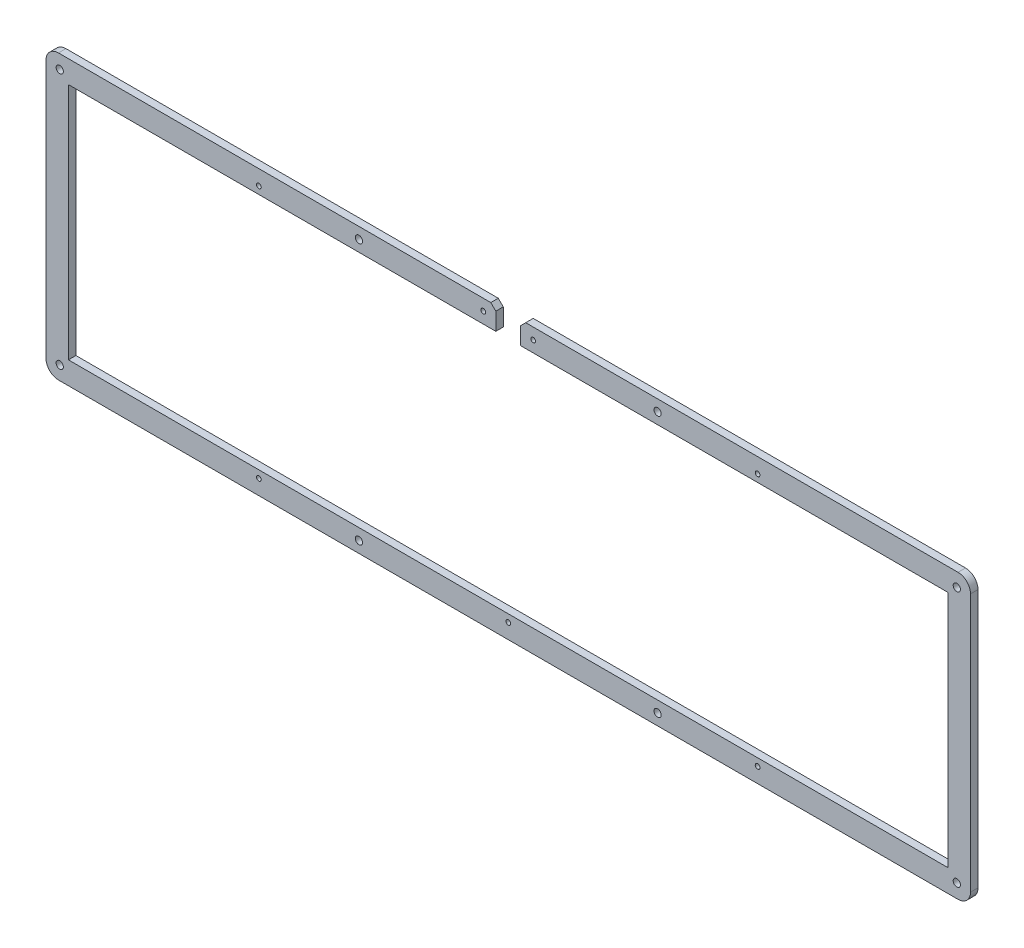
ISO-10303-21;
HEADER;
FILE_DESCRIPTION(('STEP AP214'),'2;1');
FILE_NAME('part.step','',(''),(''),'','','');
FILE_SCHEMA(('AUTOMOTIVE_DESIGN { 1 0 10303 214 1 1 1 1 }'));
ENDSEC;
DATA;
#1=APPLICATION_CONTEXT('core data for automotive mechanical design processes');
#2=APPLICATION_PROTOCOL_DEFINITION('international standard','automotive_design',2000,#1);
#3=PRODUCT_CONTEXT('',#1,'mechanical');
#4=PRODUCT('Part','Part','',(#3));
#5=PRODUCT_RELATED_PRODUCT_CATEGORY('part','',(#4));
#6=PRODUCT_DEFINITION_FORMATION('','',#4);
#7=PRODUCT_DEFINITION_CONTEXT('part definition',#1,'design');
#8=PRODUCT_DEFINITION('design','',#6,#7);
#9=PRODUCT_DEFINITION_SHAPE('','',#8);
#10=(LENGTH_UNIT() NAMED_UNIT(*) SI_UNIT(.MILLI.,.METRE.));
#11=(NAMED_UNIT(*) PLANE_ANGLE_UNIT() SI_UNIT($,.RADIAN.));
#12=(NAMED_UNIT(*) SI_UNIT($,.STERADIAN.) SOLID_ANGLE_UNIT());
#13=UNCERTAINTY_MEASURE_WITH_UNIT(LENGTH_MEASURE(1.E-05),#10,'distance_accuracy_value','');
#14=(GEOMETRIC_REPRESENTATION_CONTEXT(3) GLOBAL_UNCERTAINTY_ASSIGNED_CONTEXT((#13)) GLOBAL_UNIT_ASSIGNED_CONTEXT((#10,
#11,#12)) REPRESENTATION_CONTEXT('',''));
#15=CARTESIAN_POINT('',(0.,0.,0.));
#16=DIRECTION('',(0.,0.,1.));
#17=DIRECTION('',(1.,0.,0.));
#18=AXIS2_PLACEMENT_3D('',#15,#16,#17);
#19=CARTESIAN_POINT('',(-1.72756497465992E-13,113.599999999987,3.));
#20=DIRECTION('',(0.,1.,0.));
#21=DIRECTION('',(-1.,0.,0.));
#22=AXIS2_PLACEMENT_3D('',#19,#20,#21);
#23=PLANE('',#22);
#24=DIRECTION('',(1.,0.,0.));
#25=VECTOR('',#24,1.);
#26=CARTESIAN_POINT('',(-1.72756497465992E-13,113.599999999987,0.));
#27=LINE('',#26,#25);
#28=CARTESIAN_POINT('',(5.00000000000091,113.599999999987,0.));
#29=VERTEX_POINT('',#28);
#30=CARTESIAN_POINT('',(178.387499999993,113.599999999987,0.));
#31=VERTEX_POINT('',#30);
#32=EDGE_CURVE('E233',#29,#31,#27,.T.);
#33=ORIENTED_EDGE('',*,*,#32,.F.);
#34=DIRECTION('',(0.,0.,-1.));
#35=VECTOR('',#34,1.);
#36=CARTESIAN_POINT('',(5.00000000000091,113.599999999987,3.));
#37=LINE('',#36,#35);
#38=CARTESIAN_POINT('',(5.00000000000091,113.599999999987,3.));
#39=VERTEX_POINT('',#38);
#40=EDGE_CURVE('E11',#39,#29,#37,.T.);
#41=ORIENTED_EDGE('',*,*,#40,.F.);
#42=DIRECTION('',(1.,0.,0.));
#43=VECTOR('',#42,1.);
#44=CARTESIAN_POINT('',(-1.72756497465992E-13,113.599999999987,3.));
#45=LINE('',#44,#43);
#46=CARTESIAN_POINT('',(178.387499999993,113.599999999987,3.));
#47=VERTEX_POINT('',#46);
#48=EDGE_CURVE('E469',#39,#47,#45,.T.);
#49=ORIENTED_EDGE('',*,*,#48,.T.);
#50=DIRECTION('',(0.,0.,-1.));
#51=VECTOR('',#50,1.);
#52=CARTESIAN_POINT('',(178.387499999993,113.599999999987,3.));
#53=LINE('',#52,#51);
#54=EDGE_CURVE('E116',#47,#31,#53,.T.);
#55=ORIENTED_EDGE('',*,*,#54,.T.);
#56=EDGE_LOOP('',(#33,#41,#49,#55));
#57=FACE_BOUND('',#56,.T.);
#58=ADVANCED_FACE('F35',(#57),#23,.T.);
#59=CARTESIAN_POINT('',(5.00000000000091,108.599999999987,3.));
#60=DIRECTION('',(0.,0.,-1.));
#61=DIRECTION('',(-1.,0.,0.));
#62=AXIS2_PLACEMENT_3D('',#59,#60,#61);
#63=CYLINDRICAL_SURFACE('',#62,5.);
#64=CARTESIAN_POINT('',(5.00000000000091,108.599999999987,0.));
#65=DIRECTION('',(0.,0.,1.));
#66=DIRECTION('',(1.,0.,0.));
#67=AXIS2_PLACEMENT_3D('',#64,#65,#66);
#68=CIRCLE('',#67,5.);
#69=CARTESIAN_POINT('',(0.,108.599999999987,0.));
#70=VERTEX_POINT('',#69);
#71=EDGE_CURVE('E231',#29,#70,#68,.T.);
#72=ORIENTED_EDGE('',*,*,#71,.T.);
#73=DIRECTION('',(0.,0.,-1.));
#74=VECTOR('',#73,1.);
#75=CARTESIAN_POINT('',(0.,108.599999999987,3.));
#76=LINE('',#75,#74);
#77=CARTESIAN_POINT('',(0.,108.599999999987,3.));
#78=VERTEX_POINT('',#77);
#79=EDGE_CURVE('E44',#78,#70,#76,.T.);
#80=ORIENTED_EDGE('',*,*,#79,.F.);
#81=CARTESIAN_POINT('',(5.00000000000091,108.599999999987,3.));
#82=DIRECTION('',(0.,0.,1.));
#83=DIRECTION('',(1.,0.,0.));
#84=AXIS2_PLACEMENT_3D('',#81,#82,#83);
#85=CIRCLE('',#84,5.);
#86=EDGE_CURVE('E471',#39,#78,#85,.T.);
#87=ORIENTED_EDGE('',*,*,#86,.F.);
#88=ORIENTED_EDGE('',*,*,#40,.T.);
#89=EDGE_LOOP('',(#72,#80,#87,#88));
#90=FACE_BOUND('',#89,.T.);
#91=ADVANCED_FACE('F232',(#90),#63,.T.);
#92=CARTESIAN_POINT('',(0.,0.,3.));
#93=DIRECTION('',(1.,0.,0.));
#94=DIRECTION('',(0.,0.,-1.));
#95=AXIS2_PLACEMENT_3D('',#92,#93,#94);
#96=PLANE('',#95);
#97=DIRECTION('',(0.,-1.,0.));
#98=VECTOR('',#97,1.);
#99=CARTESIAN_POINT('',(0.,0.,0.));
#100=LINE('',#99,#98);
#101=CARTESIAN_POINT('',(0.,5.00000000000057,0.));
#102=VERTEX_POINT('',#101);
#103=EDGE_CURVE('E225',#70,#102,#100,.T.);
#104=ORIENTED_EDGE('',*,*,#103,.T.);
#105=DIRECTION('',(0.,0.,-1.));
#106=VECTOR('',#105,1.);
#107=CARTESIAN_POINT('',(0.,5.00000000000057,3.));
#108=LINE('',#107,#106);
#109=CARTESIAN_POINT('',(0.,5.00000000000057,3.));
#110=VERTEX_POINT('',#109);
#111=EDGE_CURVE('E216',#110,#102,#108,.T.);
#112=ORIENTED_EDGE('',*,*,#111,.F.);
#113=DIRECTION('',(0.,-1.,0.));
#114=VECTOR('',#113,1.);
#115=CARTESIAN_POINT('',(0.,0.,3.));
#116=LINE('',#115,#114);
#117=EDGE_CURVE('E227',#78,#110,#116,.T.);
#118=ORIENTED_EDGE('',*,*,#117,.F.);
#119=ORIENTED_EDGE('',*,*,#79,.T.);
#120=EDGE_LOOP('',(#104,#112,#118,#119));
#121=FACE_BOUND('',#120,.T.);
#122=ADVANCED_FACE('F223',(#121),#96,.F.);
#123=CARTESIAN_POINT('',(5.00000000000091,5.00000000000057,3.));
#124=DIRECTION('',(0.,0.,-1.));
#125=DIRECTION('',(-1.,0.,0.));
#126=AXIS2_PLACEMENT_3D('',#123,#124,#125);
#127=CYLINDRICAL_SURFACE('',#126,5.);
#128=CARTESIAN_POINT('',(5.00000000000091,5.00000000000057,0.));
#129=DIRECTION('',(0.,0.,1.));
#130=DIRECTION('',(1.,0.,0.));
#131=AXIS2_PLACEMENT_3D('',#128,#129,#130);
#132=CIRCLE('',#131,5.);
#133=CARTESIAN_POINT('',(5.00000000000091,0.,0.));
#134=VERTEX_POINT('',#133);
#135=EDGE_CURVE('E235',#102,#134,#132,.T.);
#136=ORIENTED_EDGE('',*,*,#135,.T.);
#137=DIRECTION('',(0.,0.,-1.));
#138=VECTOR('',#137,1.);
#139=CARTESIAN_POINT('',(5.00000000000091,0.,3.));
#140=LINE('',#139,#138);
#141=CARTESIAN_POINT('',(5.00000000000091,0.,3.));
#142=VERTEX_POINT('',#141);
#143=EDGE_CURVE('E214',#142,#134,#140,.T.);
#144=ORIENTED_EDGE('',*,*,#143,.F.);
#145=CARTESIAN_POINT('',(5.00000000000091,5.00000000000057,3.));
#146=DIRECTION('',(0.,0.,1.));
#147=DIRECTION('',(1.,0.,0.));
#148=AXIS2_PLACEMENT_3D('',#145,#146,#147);
#149=CIRCLE('',#148,5.);
#150=EDGE_CURVE('E478',#110,#142,#149,.T.);
#151=ORIENTED_EDGE('',*,*,#150,.F.);
#152=ORIENTED_EDGE('',*,*,#111,.T.);
#153=EDGE_LOOP('',(#136,#144,#151,#152));
#154=FACE_BOUND('',#153,.T.);
#155=ADVANCED_FACE('F351',(#154),#127,.T.);
#156=CARTESIAN_POINT('',(0.,0.,3.));
#157=DIRECTION('',(0.,-1.,0.));
#158=DIRECTION('',(1.,0.,0.));
#159=AXIS2_PLACEMENT_3D('',#156,#157,#158);
#160=PLANE('',#159);
#161=DIRECTION('',(-1.,0.,0.));
#162=VECTOR('',#161,1.);
#163=CARTESIAN_POINT('',(0.,0.,0.));
#164=LINE('',#163,#162);
#165=CARTESIAN_POINT('',(365.774999999985,-5.76312148397536E-13,0.));
#166=VERTEX_POINT('',#165);
#167=EDGE_CURVE('E243',#166,#134,#164,.T.);
#168=ORIENTED_EDGE('',*,*,#167,.F.);
#169=DIRECTION('',(0.,0.,-1.));
#170=VECTOR('',#169,1.);
#171=CARTESIAN_POINT('',(365.774999999985,-5.76312148397536E-13,3.));
#172=LINE('',#171,#170);
#173=CARTESIAN_POINT('',(365.774999999985,-5.76312148397536E-13,3.));
#174=VERTEX_POINT('',#173);
#175=EDGE_CURVE('E212',#174,#166,#172,.T.);
#176=ORIENTED_EDGE('',*,*,#175,.F.);
#177=DIRECTION('',(-1.,0.,0.));
#178=VECTOR('',#177,1.);
#179=CARTESIAN_POINT('',(0.,0.,3.));
#180=LINE('',#179,#178);
#181=EDGE_CURVE('E480',#174,#142,#180,.T.);
#182=ORIENTED_EDGE('',*,*,#181,.T.);
#183=ORIENTED_EDGE('',*,*,#143,.T.);
#184=EDGE_LOOP('',(#168,#176,#182,#183));
#185=FACE_BOUND('',#184,.T.);
#186=ADVANCED_FACE('F354',(#185),#160,.T.);
#187=CARTESIAN_POINT('',(365.774999999985,5.,3.));
#188=DIRECTION('',(0.,0.,-1.));
#189=DIRECTION('',(-1.,0.,0.));
#190=AXIS2_PLACEMENT_3D('',#187,#188,#189);
#191=CYLINDRICAL_SURFACE('',#190,5.);
#192=CARTESIAN_POINT('',(365.774999999985,5.,0.));
#193=DIRECTION('',(0.,0.,1.));
#194=DIRECTION('',(1.,0.,0.));
#195=AXIS2_PLACEMENT_3D('',#192,#193,#194);
#196=CIRCLE('',#195,5.);
#197=CARTESIAN_POINT('',(370.774999999985,5.00000000000057,0.));
#198=VERTEX_POINT('',#197);
#199=EDGE_CURVE('E246',#166,#198,#196,.T.);
#200=ORIENTED_EDGE('',*,*,#199,.T.);
#201=DIRECTION('',(0.,0.,-1.));
#202=VECTOR('',#201,1.);
#203=CARTESIAN_POINT('',(370.774999999985,5.00000000000057,3.));
#204=LINE('',#203,#202);
#205=CARTESIAN_POINT('',(370.774999999985,5.00000000000057,3.));
#206=VERTEX_POINT('',#205);
#207=EDGE_CURVE('E210',#206,#198,#204,.T.);
#208=ORIENTED_EDGE('',*,*,#207,.F.);
#209=CARTESIAN_POINT('',(365.774999999985,5.,3.));
#210=DIRECTION('',(0.,0.,1.));
#211=DIRECTION('',(1.,0.,0.));
#212=AXIS2_PLACEMENT_3D('',#209,#210,#211);
#213=CIRCLE('',#212,5.);
#214=EDGE_CURVE('E483',#174,#206,#213,.T.);
#215=ORIENTED_EDGE('',*,*,#214,.F.);
#216=ORIENTED_EDGE('',*,*,#175,.T.);
#217=EDGE_LOOP('',(#200,#208,#215,#216));
#218=FACE_BOUND('',#217,.T.);
#219=ADVANCED_FACE('F358',(#218),#191,.T.);
#220=CARTESIAN_POINT('',(370.774999999985,0.,3.));
#221=DIRECTION('',(1.,0.,0.));
#222=DIRECTION('',(0.,0.,-1.));
#223=AXIS2_PLACEMENT_3D('',#220,#221,#222);
#224=PLANE('',#223);
#225=DIRECTION('',(0.,-1.,0.));
#226=VECTOR('',#225,1.);
#227=CARTESIAN_POINT('',(370.774999999985,0.,0.));
#228=LINE('',#227,#226);
#229=CARTESIAN_POINT('',(370.774999999985,108.6,0.));
#230=VERTEX_POINT('',#229);
#231=EDGE_CURVE('E249',#230,#198,#228,.T.);
#232=ORIENTED_EDGE('',*,*,#231,.F.);
#233=DIRECTION('',(0.,0.,-1.));
#234=VECTOR('',#233,1.);
#235=CARTESIAN_POINT('',(370.774999999985,108.6,3.));
#236=LINE('',#235,#234);
#237=CARTESIAN_POINT('',(370.774999999985,108.6,3.));
#238=VERTEX_POINT('',#237);
#239=EDGE_CURVE('E208',#238,#230,#236,.T.);
#240=ORIENTED_EDGE('',*,*,#239,.F.);
#241=DIRECTION('',(0.,-1.,0.));
#242=VECTOR('',#241,1.);
#243=CARTESIAN_POINT('',(370.774999999985,0.,3.));
#244=LINE('',#243,#242);
#245=EDGE_CURVE('E485',#238,#206,#244,.T.);
#246=ORIENTED_EDGE('',*,*,#245,.T.);
#247=ORIENTED_EDGE('',*,*,#207,.T.);
#248=EDGE_LOOP('',(#232,#240,#246,#247));
#249=FACE_BOUND('',#248,.T.);
#250=ADVANCED_FACE('F362',(#249),#224,.T.);
#251=CARTESIAN_POINT('',(365.774999999985,108.599999999999,3.));
#252=DIRECTION('',(0.,0.,-1.));
#253=DIRECTION('',(-1.,0.,0.));
#254=AXIS2_PLACEMENT_3D('',#251,#252,#253);
#255=CYLINDRICAL_SURFACE('',#254,5.);
#256=CARTESIAN_POINT('',(365.774999999985,108.599999999999,0.));
#257=DIRECTION('',(0.,0.,1.));
#258=DIRECTION('',(1.,0.,0.));
#259=AXIS2_PLACEMENT_3D('',#256,#257,#258);
#260=CIRCLE('',#259,5.);
#261=CARTESIAN_POINT('',(365.774999999985,113.599999999999,0.));
#262=VERTEX_POINT('',#261);
#263=EDGE_CURVE('E252',#230,#262,#260,.T.);
#264=ORIENTED_EDGE('',*,*,#263,.T.);
#265=DIRECTION('',(0.,0.,-1.));
#266=VECTOR('',#265,1.);
#267=CARTESIAN_POINT('',(365.774999999985,113.599999999999,3.));
#268=LINE('',#267,#266);
#269=CARTESIAN_POINT('',(365.774999999985,113.599999999999,3.));
#270=VERTEX_POINT('',#269);
#271=EDGE_CURVE('E206',#270,#262,#268,.T.);
#272=ORIENTED_EDGE('',*,*,#271,.F.);
#273=CARTESIAN_POINT('',(365.774999999985,108.599999999999,3.));
#274=DIRECTION('',(0.,0.,1.));
#275=DIRECTION('',(1.,0.,0.));
#276=AXIS2_PLACEMENT_3D('',#273,#274,#275);
#277=CIRCLE('',#276,5.);
#278=EDGE_CURVE('E488',#238,#270,#277,.T.);
#279=ORIENTED_EDGE('',*,*,#278,.F.);
#280=ORIENTED_EDGE('',*,*,#239,.T.);
#281=EDGE_LOOP('',(#264,#272,#279,#280));
#282=FACE_BOUND('',#281,.T.);
#283=ADVANCED_FACE('F366',(#282),#255,.T.);
#284=CARTESIAN_POINT('',(0.,113.599999999999,3.));
#285=DIRECTION('',(0.,1.,0.));
#286=DIRECTION('',(0.,0.,1.));
#287=AXIS2_PLACEMENT_3D('',#284,#285,#286);
#288=PLANE('',#287);
#289=DIRECTION('',(1.,0.,0.));
#290=VECTOR('',#289,1.);
#291=CARTESIAN_POINT('',(0.,113.599999999999,0.));
#292=LINE('',#291,#290);
#293=CARTESIAN_POINT('',(192.387499999993,113.599999999999,0.));
#294=VERTEX_POINT('',#293);
#295=EDGE_CURVE('E255',#294,#262,#292,.T.);
#296=ORIENTED_EDGE('',*,*,#295,.F.);
#297=DIRECTION('',(0.,0.,-1.));
#298=VECTOR('',#297,1.);
#299=CARTESIAN_POINT('',(192.387499999993,113.599999999999,3.));
#300=LINE('',#299,#298);
#301=CARTESIAN_POINT('',(192.387499999993,113.599999999999,3.));
#302=VERTEX_POINT('',#301);
#303=EDGE_CURVE('E204',#302,#294,#300,.T.);
#304=ORIENTED_EDGE('',*,*,#303,.F.);
#305=DIRECTION('',(1.,0.,0.));
#306=VECTOR('',#305,1.);
#307=CARTESIAN_POINT('',(0.,113.599999999999,3.));
#308=LINE('',#307,#306);
#309=EDGE_CURVE('E490',#302,#270,#308,.T.);
#310=ORIENTED_EDGE('',*,*,#309,.T.);
#311=ORIENTED_EDGE('',*,*,#271,.T.);
#312=EDGE_LOOP('',(#296,#304,#310,#311));
#313=FACE_BOUND('',#312,.T.);
#314=ADVANCED_FACE('F370',(#313),#288,.T.);
#315=CARTESIAN_POINT('',(39.3937499999968,-39.3937499999968,3.));
#316=DIRECTION('',(-0.707106781186547,0.707106781186547,0.));
#317=DIRECTION('',(-0.707106781186548,-0.707106781186548,0.));
#318=AXIS2_PLACEMENT_3D('',#315,#316,#317);
#319=PLANE('',#318);
#320=DIRECTION('',(0.707106781186548,0.707106781186548,0.));
#321=VECTOR('',#320,1.);
#322=CARTESIAN_POINT('',(39.3937499999968,-39.3937499999968,0.));
#323=LINE('',#322,#321);
#324=CARTESIAN_POINT('',(190.387499999994,111.6,0.));
#325=VERTEX_POINT('',#324);
#326=EDGE_CURVE('E258',#325,#294,#323,.T.);
#327=ORIENTED_EDGE('',*,*,#326,.F.);
#328=DIRECTION('',(0.,0.,-1.));
#329=VECTOR('',#328,1.);
#330=CARTESIAN_POINT('',(190.387499999994,111.6,3.));
#331=LINE('',#330,#329);
#332=CARTESIAN_POINT('',(190.387499999994,111.6,3.));
#333=VERTEX_POINT('',#332);
#334=EDGE_CURVE('E202',#333,#325,#331,.T.);
#335=ORIENTED_EDGE('',*,*,#334,.F.);
#336=DIRECTION('',(0.707106781186548,0.707106781186548,0.));
#337=VECTOR('',#336,1.);
#338=CARTESIAN_POINT('',(39.3937499999968,-39.3937499999968,3.));
#339=LINE('',#338,#337);
#340=EDGE_CURVE('E493',#333,#302,#339,.T.);
#341=ORIENTED_EDGE('',*,*,#340,.T.);
#342=ORIENTED_EDGE('',*,*,#303,.T.);
#343=EDGE_LOOP('',(#327,#335,#341,#342));
#344=FACE_BOUND('',#343,.T.);
#345=ADVANCED_FACE('F374',(#344),#319,.T.);
#346=CARTESIAN_POINT('',(190.387500000026,5.51078528048986E-11,3.));
#347=DIRECTION('',(-1.,-2.89451002848879E-13,0.));
#348=DIRECTION('',(2.89451002848879E-13,-1.,0.));
#349=AXIS2_PLACEMENT_3D('',#346,#347,#348);
#350=PLANE('',#349);
#351=DIRECTION('',(-2.89451002848879E-13,1.,0.));
#352=VECTOR('',#351,1.);
#353=CARTESIAN_POINT('',(190.387500000026,5.51078528048986E-11,0.));
#354=LINE('',#353,#352);
#355=CARTESIAN_POINT('',(190.387499999996,104.600000000004,0.));
#356=VERTEX_POINT('',#355);
#357=EDGE_CURVE('E261',#356,#325,#354,.T.);
#358=ORIENTED_EDGE('',*,*,#357,.F.);
#359=DIRECTION('',(0.,0.,-1.));
#360=VECTOR('',#359,1.);
#361=CARTESIAN_POINT('',(190.387499999996,104.600000000004,3.));
#362=LINE('',#361,#360);
#363=CARTESIAN_POINT('',(190.387499999996,104.600000000004,3.));
#364=VERTEX_POINT('',#363);
#365=EDGE_CURVE('E200',#364,#356,#362,.T.);
#366=ORIENTED_EDGE('',*,*,#365,.F.);
#367=DIRECTION('',(-2.89451002848879E-13,1.,0.));
#368=VECTOR('',#367,1.);
#369=CARTESIAN_POINT('',(190.387500000026,5.51078528048986E-11,3.));
#370=LINE('',#369,#368);
#371=EDGE_CURVE('E496',#364,#333,#370,.T.);
#372=ORIENTED_EDGE('',*,*,#371,.T.);
#373=ORIENTED_EDGE('',*,*,#334,.T.);
#374=EDGE_LOOP('',(#358,#366,#372,#373));
#375=FACE_BOUND('',#374,.T.);
#376=ADVANCED_FACE('F378',(#375),#350,.T.);
#377=CARTESIAN_POINT('',(0.,104.600000000004,3.));
#378=DIRECTION('',(0.,1.,0.));
#379=DIRECTION('',(0.,0.,1.));
#380=AXIS2_PLACEMENT_3D('',#377,#378,#379);
#381=PLANE('',#380);
#382=DIRECTION('',(1.,0.,0.));
#383=VECTOR('',#382,1.);
#384=CARTESIAN_POINT('',(0.,104.600000000004,0.));
#385=LINE('',#384,#383);
#386=CARTESIAN_POINT('',(361.774999999976,104.600000000004,0.));
#387=VERTEX_POINT('',#386);
#388=EDGE_CURVE('E264',#356,#387,#385,.T.);
#389=ORIENTED_EDGE('',*,*,#388,.T.);
#390=DIRECTION('',(0.,0.,-1.));
#391=VECTOR('',#390,1.);
#392=CARTESIAN_POINT('',(361.774999999976,104.600000000004,3.));
#393=LINE('',#392,#391);
#394=CARTESIAN_POINT('',(361.774999999976,104.600000000004,3.));
#395=VERTEX_POINT('',#394);
#396=EDGE_CURVE('E197',#395,#387,#393,.T.);
#397=ORIENTED_EDGE('',*,*,#396,.F.);
#398=DIRECTION('',(1.,0.,0.));
#399=VECTOR('',#398,1.);
#400=CARTESIAN_POINT('',(0.,104.600000000004,3.));
#401=LINE('',#400,#399);
#402=EDGE_CURVE('E499',#364,#395,#401,.T.);
#403=ORIENTED_EDGE('',*,*,#402,.F.);
#404=ORIENTED_EDGE('',*,*,#365,.T.);
#405=EDGE_LOOP('',(#389,#397,#403,#404));
#406=FACE_BOUND('',#405,.T.);
#407=ADVANCED_FACE('F382',(#406),#381,.F.);
#408=CARTESIAN_POINT('',(361.774999999976,0.,3.));
#409=DIRECTION('',(1.,0.,0.));
#410=DIRECTION('',(0.,0.,-1.));
#411=AXIS2_PLACEMENT_3D('',#408,#409,#410);
#412=PLANE('',#411);
#413=DIRECTION('',(0.,-1.,0.));
#414=VECTOR('',#413,1.);
#415=CARTESIAN_POINT('',(361.774999999976,0.,0.));
#416=LINE('',#415,#414);
#417=CARTESIAN_POINT('',(361.774999999976,9.00000000000057,0.));
#418=VERTEX_POINT('',#417);
#419=EDGE_CURVE('E267',#387,#418,#416,.T.);
#420=ORIENTED_EDGE('',*,*,#419,.T.);
#421=DIRECTION('',(0.,0.,-1.));
#422=VECTOR('',#421,1.);
#423=CARTESIAN_POINT('',(361.774999999976,9.00000000000057,3.));
#424=LINE('',#423,#422);
#425=CARTESIAN_POINT('',(361.774999999976,9.00000000000057,3.));
#426=VERTEX_POINT('',#425);
#427=EDGE_CURVE('E194',#426,#418,#424,.T.);
#428=ORIENTED_EDGE('',*,*,#427,.F.);
#429=DIRECTION('',(0.,-1.,0.));
#430=VECTOR('',#429,1.);
#431=CARTESIAN_POINT('',(361.774999999976,0.,3.));
#432=LINE('',#431,#430);
#433=EDGE_CURVE('E502',#395,#426,#432,.T.);
#434=ORIENTED_EDGE('',*,*,#433,.F.);
#435=ORIENTED_EDGE('',*,*,#396,.T.);
#436=EDGE_LOOP('',(#420,#428,#434,#435));
#437=FACE_BOUND('',#436,.T.);
#438=ADVANCED_FACE('F386',(#437),#412,.F.);
#439=CARTESIAN_POINT('',(0.,9.00000000000057,3.));
#440=DIRECTION('',(0.,-1.,0.));
#441=DIRECTION('',(1.,0.,0.));
#442=AXIS2_PLACEMENT_3D('',#439,#440,#441);
#443=PLANE('',#442);
#444=DIRECTION('',(-1.,0.,0.));
#445=VECTOR('',#444,1.);
#446=CARTESIAN_POINT('',(0.,9.00000000000057,0.));
#447=LINE('',#446,#445);
#448=CARTESIAN_POINT('',(9.00000000000364,9.00000000000057,0.));
#449=VERTEX_POINT('',#448);
#450=EDGE_CURVE('E270',#418,#449,#447,.T.);
#451=ORIENTED_EDGE('',*,*,#450,.T.);
#452=DIRECTION('',(0.,0.,-1.));
#453=VECTOR('',#452,1.);
#454=CARTESIAN_POINT('',(9.00000000000364,9.00000000000057,3.));
#455=LINE('',#454,#453);
#456=CARTESIAN_POINT('',(9.00000000000364,9.00000000000057,3.));
#457=VERTEX_POINT('',#456);
#458=EDGE_CURVE('E188',#457,#449,#455,.T.);
#459=ORIENTED_EDGE('',*,*,#458,.F.);
#460=DIRECTION('',(-1.,0.,0.));
#461=VECTOR('',#460,1.);
#462=CARTESIAN_POINT('',(0.,9.00000000000057,3.));
#463=LINE('',#462,#461);
#464=EDGE_CURVE('E505',#426,#457,#463,.T.);
#465=ORIENTED_EDGE('',*,*,#464,.F.);
#466=ORIENTED_EDGE('',*,*,#427,.T.);
#467=EDGE_LOOP('',(#451,#459,#465,#466));
#468=FACE_BOUND('',#467,.T.);
#469=ADVANCED_FACE('F390',(#468),#443,.F.);
#470=CARTESIAN_POINT('',(9.00000000000364,0.,3.));
#471=DIRECTION('',(1.,0.,0.));
#472=DIRECTION('',(0.,0.,-1.));
#473=AXIS2_PLACEMENT_3D('',#470,#471,#472);
#474=PLANE('',#473);
#475=DIRECTION('',(0.,-1.,0.));
#476=VECTOR('',#475,1.);
#477=CARTESIAN_POINT('',(9.00000000000364,0.,0.));
#478=LINE('',#477,#476);
#479=CARTESIAN_POINT('',(9.00000000000364,104.599999999987,0.));
#480=VERTEX_POINT('',#479);
#481=EDGE_CURVE('E273',#480,#449,#478,.T.);
#482=ORIENTED_EDGE('',*,*,#481,.F.);
#483=DIRECTION('',(0.,0.,-1.));
#484=VECTOR('',#483,1.);
#485=CARTESIAN_POINT('',(9.00000000000364,104.599999999987,3.));
#486=LINE('',#485,#484);
#487=CARTESIAN_POINT('',(9.00000000000364,104.599999999987,3.));
#488=VERTEX_POINT('',#487);
#489=EDGE_CURVE('E186',#488,#480,#486,.T.);
#490=ORIENTED_EDGE('',*,*,#489,.F.);
#491=DIRECTION('',(0.,-1.,0.));
#492=VECTOR('',#491,1.);
#493=CARTESIAN_POINT('',(9.00000000000364,0.,3.));
#494=LINE('',#493,#492);
#495=EDGE_CURVE('E180',#488,#457,#494,.T.);
#496=ORIENTED_EDGE('',*,*,#495,.T.);
#497=ORIENTED_EDGE('',*,*,#458,.T.);
#498=EDGE_LOOP('',(#482,#490,#496,#497));
#499=FACE_BOUND('',#498,.T.);
#500=ADVANCED_FACE('F394',(#499),#474,.T.);
#501=CARTESIAN_POINT('',(0.,104.599999999987,3.));
#502=DIRECTION('',(0.,1.,0.));
#503=DIRECTION('',(-1.,0.,0.));
#504=AXIS2_PLACEMENT_3D('',#501,#502,#503);
#505=PLANE('',#504);
#506=DIRECTION('',(1.,0.,0.));
#507=VECTOR('',#506,1.);
#508=CARTESIAN_POINT('',(0.,104.599999999987,0.));
#509=LINE('',#508,#507);
#510=CARTESIAN_POINT('',(180.387499999993,104.599999999987,0.));
#511=VERTEX_POINT('',#510);
#512=EDGE_CURVE('E185',#480,#511,#509,.T.);
#513=ORIENTED_EDGE('',*,*,#512,.T.);
#514=DIRECTION('',(0.,0.,-1.));
#515=VECTOR('',#514,1.);
#516=CARTESIAN_POINT('',(180.387499999993,104.599999999987,3.));
#517=LINE('',#516,#515);
#518=CARTESIAN_POINT('',(180.387499999993,104.599999999987,3.));
#519=VERTEX_POINT('',#518);
#520=EDGE_CURVE('E171',#519,#511,#517,.T.);
#521=ORIENTED_EDGE('',*,*,#520,.F.);
#522=DIRECTION('',(1.,0.,0.));
#523=VECTOR('',#522,1.);
#524=CARTESIAN_POINT('',(0.,104.599999999987,3.));
#525=LINE('',#524,#523);
#526=EDGE_CURVE('E174',#488,#519,#525,.T.);
#527=ORIENTED_EDGE('',*,*,#526,.F.);
#528=ORIENTED_EDGE('',*,*,#489,.T.);
#529=EDGE_LOOP('',(#513,#521,#527,#528));
#530=FACE_BOUND('',#529,.T.);
#531=ADVANCED_FACE('F183',(#530),#505,.F.);
#532=CARTESIAN_POINT('',(180.387499999993,7.15251270909131E-13,3.));
#533=DIRECTION('',(-1.,0.,0.));
#534=DIRECTION('',(0.,-1.,0.));
#535=AXIS2_PLACEMENT_3D('',#532,#533,#534);
#536=PLANE('',#535);
#537=DIRECTION('',(0.,1.,0.));
#538=VECTOR('',#537,1.);
#539=CARTESIAN_POINT('',(180.387499999993,7.15251270909131E-13,0.));
#540=LINE('',#539,#538);
#541=CARTESIAN_POINT('',(180.387499999993,111.599999999987,0.));
#542=VERTEX_POINT('',#541);
#543=EDGE_CURVE('E277',#511,#542,#540,.T.);
#544=ORIENTED_EDGE('',*,*,#543,.T.);
#545=DIRECTION('',(0.,0.,-1.));
#546=VECTOR('',#545,1.);
#547=CARTESIAN_POINT('',(180.387499999993,111.599999999987,3.));
#548=LINE('',#547,#546);
#549=CARTESIAN_POINT('',(180.387499999993,111.599999999987,3.));
#550=VERTEX_POINT('',#549);
#551=EDGE_CURVE('E173',#550,#542,#548,.T.);
#552=ORIENTED_EDGE('',*,*,#551,.F.);
#553=DIRECTION('',(0.,1.,0.));
#554=VECTOR('',#553,1.);
#555=CARTESIAN_POINT('',(180.387499999993,7.15251270909131E-13,3.));
#556=LINE('',#555,#554);
#557=EDGE_CURVE('E166',#519,#550,#556,.T.);
#558=ORIENTED_EDGE('',*,*,#557,.F.);
#559=ORIENTED_EDGE('',*,*,#520,.T.);
#560=EDGE_LOOP('',(#544,#552,#558,#559));
#561=FACE_BOUND('',#560,.T.);
#562=ADVANCED_FACE('F169',(#561),#536,.F.);
#563=CARTESIAN_POINT('',(125.500000000001,4.49999999998124,3.));
#564=DIRECTION('',(0.,0.,-1.));
#565=DIRECTION('',(-1.,0.,0.));
#566=AXIS2_PLACEMENT_3D('',#563,#564,#565);
#567=CYLINDRICAL_SURFACE('',#566,1.45000000000001);
#568=CARTESIAN_POINT('',(125.500000000001,4.49999999998124,3.));
#569=DIRECTION('',(0.,0.,1.));
#570=DIRECTION('',(1.,0.,0.));
#571=AXIS2_PLACEMENT_3D('',#568,#569,#570);
#572=CIRCLE('',#571,1.45000000000001);
#573=CARTESIAN_POINT('',(126.950000000001,4.49999999998124,3.));
#574=VERTEX_POINT('',#573);
#575=EDGE_CURVE('E468',#574,#574,#572,.T.);
#576=ORIENTED_EDGE('',*,*,#575,.T.);
#577=EDGE_LOOP('',(#576));
#578=FACE_BOUND('',#577,.T.);
#579=CARTESIAN_POINT('',(125.500000000001,4.49999999998124,0.));
#580=DIRECTION('',(0.,0.,1.));
#581=DIRECTION('',(1.,0.,0.));
#582=AXIS2_PLACEMENT_3D('',#579,#580,#581);
#583=CIRCLE('',#582,1.45000000000001);
#584=CARTESIAN_POINT('',(126.950000000001,4.49999999998124,0.));
#585=VERTEX_POINT('',#584);
#586=EDGE_CURVE('E237',#585,#585,#583,.T.);
#587=ORIENTED_EDGE('',*,*,#586,.F.);
#588=EDGE_LOOP('',(#587));
#589=FACE_BOUND('',#588,.T.);
#590=ADVANCED_FACE('F328',(#578,#589),#567,.F.);
#591=CARTESIAN_POINT('',(195.387499999993,109.099999999967,3.));
#592=DIRECTION('',(0.,0.,-1.));
#593=DIRECTION('',(-1.,0.,0.));
#594=AXIS2_PLACEMENT_3D('',#591,#592,#593);
#595=CYLINDRICAL_SURFACE('',#594,0.950000000000003);
#596=CARTESIAN_POINT('',(195.387499999993,109.099999999967,3.));
#597=DIRECTION('',(0.,0.,1.));
#598=DIRECTION('',(1.,0.,0.));
#599=AXIS2_PLACEMENT_3D('',#596,#597,#598);
#600=CIRCLE('',#599,0.950000000000003);
#601=CARTESIAN_POINT('',(196.337499999993,109.099999999967,3.));
#602=VERTEX_POINT('',#601);
#603=EDGE_CURVE('E466',#602,#602,#600,.T.);
#604=ORIENTED_EDGE('',*,*,#603,.T.);
#605=EDGE_LOOP('',(#604));
#606=FACE_BOUND('',#605,.T.);
#607=CARTESIAN_POINT('',(195.387499999993,109.099999999967,0.));
#608=DIRECTION('',(0.,0.,1.));
#609=DIRECTION('',(1.,0.,0.));
#610=AXIS2_PLACEMENT_3D('',#607,#608,#609);
#611=CIRCLE('',#610,0.950000000000003);
#612=CARTESIAN_POINT('',(196.337499999993,109.099999999967,0.));
#613=VERTEX_POINT('',#612);
#614=EDGE_CURVE('E321',#613,#613,#611,.T.);
#615=ORIENTED_EDGE('',*,*,#614,.F.);
#616=EDGE_LOOP('',(#615));
#617=FACE_BOUND('',#616,.T.);
#618=ADVANCED_FACE('F330',(#606,#617),#595,.F.);
#619=CARTESIAN_POINT('',(175.387499999993,109.099999999967,3.));
#620=DIRECTION('',(0.,0.,-1.));
#621=DIRECTION('',(-1.,0.,0.));
#622=AXIS2_PLACEMENT_3D('',#619,#620,#621);
#623=CYLINDRICAL_SURFACE('',#622,0.950000000000003);
#624=CARTESIAN_POINT('',(175.387499999993,109.099999999967,3.));
#625=DIRECTION('',(0.,0.,1.));
#626=DIRECTION('',(1.,0.,0.));
#627=AXIS2_PLACEMENT_3D('',#624,#625,#626);
#628=CIRCLE('',#627,0.950000000000003);
#629=CARTESIAN_POINT('',(176.337499999993,109.099999999967,3.));
#630=VERTEX_POINT('',#629);
#631=EDGE_CURVE('E462',#630,#630,#628,.T.);
#632=ORIENTED_EDGE('',*,*,#631,.T.);
#633=EDGE_LOOP('',(#632));
#634=FACE_BOUND('',#633,.T.);
#635=CARTESIAN_POINT('',(175.387499999993,109.099999999967,0.));
#636=DIRECTION('',(0.,0.,1.));
#637=DIRECTION('',(1.,0.,0.));
#638=AXIS2_PLACEMENT_3D('',#635,#636,#637);
#639=CIRCLE('',#638,0.950000000000003);
#640=CARTESIAN_POINT('',(176.337499999993,109.099999999967,0.));
#641=VERTEX_POINT('',#640);
#642=EDGE_CURVE('E318',#641,#641,#639,.T.);
#643=ORIENTED_EDGE('',*,*,#642,.F.);
#644=EDGE_LOOP('',(#643));
#645=FACE_BOUND('',#644,.T.);
#646=ADVANCED_FACE('F337',(#634,#645),#623,.F.);
#647=CARTESIAN_POINT('',(5.50000000000091,108.099999999967,3.));
#648=DIRECTION('',(0.,0.,-1.));
#649=DIRECTION('',(-1.,0.,0.));
#650=AXIS2_PLACEMENT_3D('',#647,#648,#649);
#651=CYLINDRICAL_SURFACE('',#650,1.45);
#652=CARTESIAN_POINT('',(5.50000000000091,108.099999999967,3.));
#653=DIRECTION('',(0.,0.,1.));
#654=DIRECTION('',(1.,0.,0.));
#655=AXIS2_PLACEMENT_3D('',#652,#653,#654);
#656=CIRCLE('',#655,1.45);
#657=CARTESIAN_POINT('',(6.95000000000091,108.099999999967,3.));
#658=VERTEX_POINT('',#657);
#659=EDGE_CURVE('E458',#658,#658,#656,.T.);
#660=ORIENTED_EDGE('',*,*,#659,.T.);
#661=EDGE_LOOP('',(#660));
#662=FACE_BOUND('',#661,.T.);
#663=CARTESIAN_POINT('',(5.50000000000091,108.099999999967,0.));
#664=DIRECTION('',(0.,0.,1.));
#665=DIRECTION('',(1.,0.,0.));
#666=AXIS2_PLACEMENT_3D('',#663,#664,#665);
#667=CIRCLE('',#666,1.45);
#668=CARTESIAN_POINT('',(6.95000000000091,108.099999999967,0.));
#669=VERTEX_POINT('',#668);
#670=EDGE_CURVE('E315',#669,#669,#667,.T.);
#671=ORIENTED_EDGE('',*,*,#670,.F.);
#672=EDGE_LOOP('',(#671));
#673=FACE_BOUND('',#672,.T.);
#674=ADVANCED_FACE('F576',(#662,#673),#651,.F.);
#675=CARTESIAN_POINT('',(5.50000000000091,5.49999999998124,3.));
#676=DIRECTION('',(0.,0.,-1.));
#677=DIRECTION('',(-1.,0.,0.));
#678=AXIS2_PLACEMENT_3D('',#675,#676,#677);
#679=CYLINDRICAL_SURFACE('',#678,1.45);
#680=CARTESIAN_POINT('',(5.50000000000091,5.49999999998124,3.));
#681=DIRECTION('',(0.,0.,1.));
#682=DIRECTION('',(1.,0.,0.));
#683=AXIS2_PLACEMENT_3D('',#680,#681,#682);
#684=CIRCLE('',#683,1.45);
#685=CARTESIAN_POINT('',(6.95000000000091,5.49999999998124,3.));
#686=VERTEX_POINT('',#685);
#687=EDGE_CURVE('E454',#686,#686,#684,.T.);
#688=ORIENTED_EDGE('',*,*,#687,.T.);
#689=EDGE_LOOP('',(#688));
#690=FACE_BOUND('',#689,.T.);
#691=CARTESIAN_POINT('',(5.50000000000091,5.49999999998124,0.));
#692=DIRECTION('',(0.,0.,1.));
#693=DIRECTION('',(1.,0.,0.));
#694=AXIS2_PLACEMENT_3D('',#691,#692,#693);
#695=CIRCLE('',#694,1.45);
#696=CARTESIAN_POINT('',(6.95000000000091,5.49999999998124,0.));
#697=VERTEX_POINT('',#696);
#698=EDGE_CURVE('E312',#697,#697,#695,.T.);
#699=ORIENTED_EDGE('',*,*,#698,.F.);
#700=EDGE_LOOP('',(#699));
#701=FACE_BOUND('',#700,.T.);
#702=ADVANCED_FACE('F582',(#690,#701),#679,.F.);
#703=CARTESIAN_POINT('',(365.274999999986,5.49999999998079,3.));
#704=DIRECTION('',(0.,0.,-1.));
#705=DIRECTION('',(-1.,0.,0.));
#706=AXIS2_PLACEMENT_3D('',#703,#704,#705);
#707=CYLINDRICAL_SURFACE('',#706,1.45000000000001);
#708=CARTESIAN_POINT('',(365.274999999986,5.49999999998079,3.));
#709=DIRECTION('',(0.,0.,1.));
#710=DIRECTION('',(1.,0.,0.));
#711=AXIS2_PLACEMENT_3D('',#708,#709,#710);
#712=CIRCLE('',#711,1.45000000000001);
#713=CARTESIAN_POINT('',(366.724999999986,5.49999999998079,3.));
#714=VERTEX_POINT('',#713);
#715=EDGE_CURVE('E450',#714,#714,#712,.T.);
#716=ORIENTED_EDGE('',*,*,#715,.T.);
#717=EDGE_LOOP('',(#716));
#718=FACE_BOUND('',#717,.T.);
#719=CARTESIAN_POINT('',(365.274999999986,5.49999999998079,0.));
#720=DIRECTION('',(0.,0.,1.));
#721=DIRECTION('',(1.,0.,0.));
#722=AXIS2_PLACEMENT_3D('',#719,#720,#721);
#723=CIRCLE('',#722,1.45000000000001);
#724=CARTESIAN_POINT('',(366.724999999986,5.49999999998079,0.));
#725=VERTEX_POINT('',#724);
#726=EDGE_CURVE('E309',#725,#725,#723,.T.);
#727=ORIENTED_EDGE('',*,*,#726,.F.);
#728=EDGE_LOOP('',(#727));
#729=FACE_BOUND('',#728,.T.);
#730=ADVANCED_FACE('F588',(#718,#729),#707,.F.);
#731=CARTESIAN_POINT('',(365.274999999986,108.09999999998,3.));
#732=DIRECTION('',(0.,0.,-1.));
#733=DIRECTION('',(-1.,0.,0.));
#734=AXIS2_PLACEMENT_3D('',#731,#732,#733);
#735=CYLINDRICAL_SURFACE('',#734,1.45000000000001);
#736=CARTESIAN_POINT('',(365.274999999986,108.09999999998,3.));
#737=DIRECTION('',(0.,0.,1.));
#738=DIRECTION('',(1.,0.,0.));
#739=AXIS2_PLACEMENT_3D('',#736,#737,#738);
#740=CIRCLE('',#739,1.45000000000001);
#741=CARTESIAN_POINT('',(366.724999999986,108.09999999998,3.));
#742=VERTEX_POINT('',#741);
#743=EDGE_CURVE('E446',#742,#742,#740,.T.);
#744=ORIENTED_EDGE('',*,*,#743,.T.);
#745=EDGE_LOOP('',(#744));
#746=FACE_BOUND('',#745,.T.);
#747=CARTESIAN_POINT('',(365.274999999986,108.09999999998,0.));
#748=DIRECTION('',(0.,0.,1.));
#749=DIRECTION('',(1.,0.,0.));
#750=AXIS2_PLACEMENT_3D('',#747,#748,#749);
#751=CIRCLE('',#750,1.45000000000001);
#752=CARTESIAN_POINT('',(366.724999999986,108.09999999998,0.));
#753=VERTEX_POINT('',#752);
#754=EDGE_CURVE('E306',#753,#753,#751,.T.);
#755=ORIENTED_EDGE('',*,*,#754,.F.);
#756=EDGE_LOOP('',(#755));
#757=FACE_BOUND('',#756,.T.);
#758=ADVANCED_FACE('F592',(#746,#757),#735,.F.);
#759=CARTESIAN_POINT('',(85.3874999999898,107.599999999969,3.));
#760=DIRECTION('',(0.,0.,-1.));
#761=DIRECTION('',(-1.,0.,0.));
#762=AXIS2_PLACEMENT_3D('',#759,#760,#761);
#763=CYLINDRICAL_SURFACE('',#762,0.950000000000003);
#764=CARTESIAN_POINT('',(85.3874999999898,107.599999999969,3.));
#765=DIRECTION('',(0.,0.,1.));
#766=DIRECTION('',(1.,0.,0.));
#767=AXIS2_PLACEMENT_3D('',#764,#765,#766);
#768=CIRCLE('',#767,0.950000000000003);
#769=CARTESIAN_POINT('',(86.3374999999898,107.599999999969,3.));
#770=VERTEX_POINT('',#769);
#771=EDGE_CURVE('E442',#770,#770,#768,.T.);
#772=ORIENTED_EDGE('',*,*,#771,.T.);
#773=EDGE_LOOP('',(#772));
#774=FACE_BOUND('',#773,.T.);
#775=CARTESIAN_POINT('',(85.3874999999898,107.599999999969,0.));
#776=DIRECTION('',(0.,0.,1.));
#777=DIRECTION('',(1.,0.,0.));
#778=AXIS2_PLACEMENT_3D('',#775,#776,#777);
#779=CIRCLE('',#778,0.950000000000003);
#780=CARTESIAN_POINT('',(86.3374999999898,107.599999999969,0.));
#781=VERTEX_POINT('',#780);
#782=EDGE_CURVE('E303',#781,#781,#779,.T.);
#783=ORIENTED_EDGE('',*,*,#782,.F.);
#784=EDGE_LOOP('',(#783));
#785=FACE_BOUND('',#784,.T.);
#786=ADVANCED_FACE('F596',(#774,#785),#763,.F.);
#787=CARTESIAN_POINT('',(285.387499999991,107.599999999972,3.));
#788=DIRECTION('',(0.,0.,-1.));
#789=DIRECTION('',(-1.,0.,0.));
#790=AXIS2_PLACEMENT_3D('',#787,#788,#789);
#791=CYLINDRICAL_SURFACE('',#790,0.950000000000029);
#792=CARTESIAN_POINT('',(285.387499999991,107.599999999972,3.));
#793=DIRECTION('',(0.,0.,1.));
#794=DIRECTION('',(1.,0.,0.));
#795=AXIS2_PLACEMENT_3D('',#792,#793,#794);
#796=CIRCLE('',#795,0.950000000000029);
#797=CARTESIAN_POINT('',(286.337499999991,107.599999999972,3.));
#798=VERTEX_POINT('',#797);
#799=EDGE_CURVE('E438',#798,#798,#796,.T.);
#800=ORIENTED_EDGE('',*,*,#799,.T.);
#801=EDGE_LOOP('',(#800));
#802=FACE_BOUND('',#801,.T.);
#803=CARTESIAN_POINT('',(285.387499999991,107.599999999972,0.));
#804=DIRECTION('',(0.,0.,1.));
#805=DIRECTION('',(1.,0.,0.));
#806=AXIS2_PLACEMENT_3D('',#803,#804,#805);
#807=CIRCLE('',#806,0.950000000000029);
#808=CARTESIAN_POINT('',(286.337499999991,107.599999999972,0.));
#809=VERTEX_POINT('',#808);
#810=EDGE_CURVE('E300',#809,#809,#807,.T.);
#811=ORIENTED_EDGE('',*,*,#810,.F.);
#812=EDGE_LOOP('',(#811));
#813=FACE_BOUND('',#812,.T.);
#814=ADVANCED_FACE('F600',(#802,#813),#791,.F.);
#815=CARTESIAN_POINT('',(85.3874999999898,5.99999999993861,3.));
#816=DIRECTION('',(0.,0.,-1.));
#817=DIRECTION('',(-1.,0.,0.));
#818=AXIS2_PLACEMENT_3D('',#815,#816,#817);
#819=CYLINDRICAL_SURFACE('',#818,0.950000000000002);
#820=CARTESIAN_POINT('',(85.3874999999898,5.99999999993861,3.));
#821=DIRECTION('',(0.,0.,1.));
#822=DIRECTION('',(1.,0.,0.));
#823=AXIS2_PLACEMENT_3D('',#820,#821,#822);
#824=CIRCLE('',#823,0.950000000000002);
#825=CARTESIAN_POINT('',(86.3374999999898,5.99999999993861,3.));
#826=VERTEX_POINT('',#825);
#827=EDGE_CURVE('E434',#826,#826,#824,.T.);
#828=ORIENTED_EDGE('',*,*,#827,.T.);
#829=EDGE_LOOP('',(#828));
#830=FACE_BOUND('',#829,.T.);
#831=CARTESIAN_POINT('',(85.3874999999898,5.99999999993861,0.));
#832=DIRECTION('',(0.,0.,1.));
#833=DIRECTION('',(1.,0.,0.));
#834=AXIS2_PLACEMENT_3D('',#831,#832,#833);
#835=CIRCLE('',#834,0.950000000000002);
#836=CARTESIAN_POINT('',(86.3374999999898,5.99999999993861,0.));
#837=VERTEX_POINT('',#836);
#838=EDGE_CURVE('E297',#837,#837,#835,.T.);
#839=ORIENTED_EDGE('',*,*,#838,.F.);
#840=EDGE_LOOP('',(#839));
#841=FACE_BOUND('',#840,.T.);
#842=ADVANCED_FACE('F604',(#830,#841),#819,.F.);
#843=CARTESIAN_POINT('',(185.38749999999,5.99999999993656,3.));
#844=DIRECTION('',(0.,0.,-1.));
#845=DIRECTION('',(-1.,0.,0.));
#846=AXIS2_PLACEMENT_3D('',#843,#844,#845);
#847=CYLINDRICAL_SURFACE('',#846,0.950000000000002);
#848=CARTESIAN_POINT('',(185.38749999999,5.99999999993656,3.));
#849=DIRECTION('',(0.,0.,1.));
#850=DIRECTION('',(1.,0.,0.));
#851=AXIS2_PLACEMENT_3D('',#848,#849,#850);
#852=CIRCLE('',#851,0.950000000000002);
#853=CARTESIAN_POINT('',(186.33749999999,5.99999999993656,3.));
#854=VERTEX_POINT('',#853);
#855=EDGE_CURVE('E430',#854,#854,#852,.T.);
#856=ORIENTED_EDGE('',*,*,#855,.T.);
#857=EDGE_LOOP('',(#856));
#858=FACE_BOUND('',#857,.T.);
#859=CARTESIAN_POINT('',(185.38749999999,5.99999999993656,0.));
#860=DIRECTION('',(0.,0.,1.));
#861=DIRECTION('',(1.,0.,0.));
#862=AXIS2_PLACEMENT_3D('',#859,#860,#861);
#863=CIRCLE('',#862,0.950000000000002);
#864=CARTESIAN_POINT('',(186.33749999999,5.99999999993656,0.));
#865=VERTEX_POINT('',#864);
#866=EDGE_CURVE('E294',#865,#865,#863,.T.);
#867=ORIENTED_EDGE('',*,*,#866,.F.);
#868=EDGE_LOOP('',(#867));
#869=FACE_BOUND('',#868,.T.);
#870=ADVANCED_FACE('F608',(#858,#869),#847,.F.);
#871=CARTESIAN_POINT('',(285.387499999991,5.99999999993485,3.));
#872=DIRECTION('',(0.,0.,-1.));
#873=DIRECTION('',(-1.,0.,0.));
#874=AXIS2_PLACEMENT_3D('',#871,#872,#873);
#875=CYLINDRICAL_SURFACE('',#874,0.950000000000028);
#876=CARTESIAN_POINT('',(285.387499999991,5.99999999993485,3.));
#877=DIRECTION('',(0.,0.,1.));
#878=DIRECTION('',(1.,0.,0.));
#879=AXIS2_PLACEMENT_3D('',#876,#877,#878);
#880=CIRCLE('',#879,0.950000000000028);
#881=CARTESIAN_POINT('',(286.337499999991,5.99999999993485,3.));
#882=VERTEX_POINT('',#881);
#883=EDGE_CURVE('E426',#882,#882,#880,.T.);
#884=ORIENTED_EDGE('',*,*,#883,.T.);
#885=EDGE_LOOP('',(#884));
#886=FACE_BOUND('',#885,.T.);
#887=CARTESIAN_POINT('',(285.387499999991,5.99999999993485,0.));
#888=DIRECTION('',(0.,0.,1.));
#889=DIRECTION('',(1.,0.,0.));
#890=AXIS2_PLACEMENT_3D('',#887,#888,#889);
#891=CIRCLE('',#890,0.950000000000028);
#892=CARTESIAN_POINT('',(286.337499999991,5.99999999993485,0.));
#893=VERTEX_POINT('',#892);
#894=EDGE_CURVE('E291',#893,#893,#891,.T.);
#895=ORIENTED_EDGE('',*,*,#894,.F.);
#896=EDGE_LOOP('',(#895));
#897=FACE_BOUND('',#896,.T.);
#898=ADVANCED_FACE('F612',(#886,#897),#875,.F.);
#899=CARTESIAN_POINT('',(245.274999999986,4.49999999998124,3.));
#900=DIRECTION('',(0.,0.,-1.));
#901=DIRECTION('',(-1.,0.,0.));
#902=AXIS2_PLACEMENT_3D('',#899,#900,#901);
#903=CYLINDRICAL_SURFACE('',#902,1.45000000000001);
#904=CARTESIAN_POINT('',(245.274999999986,4.49999999998124,3.));
#905=DIRECTION('',(0.,0.,1.));
#906=DIRECTION('',(1.,0.,0.));
#907=AXIS2_PLACEMENT_3D('',#904,#905,#906);
#908=CIRCLE('',#907,1.45000000000001);
#909=CARTESIAN_POINT('',(246.724999999985,4.49999999998124,3.));
#910=VERTEX_POINT('',#909);
#911=EDGE_CURVE('E422',#910,#910,#908,.T.);
#912=ORIENTED_EDGE('',*,*,#911,.T.);
#913=EDGE_LOOP('',(#912));
#914=FACE_BOUND('',#913,.T.);
#915=CARTESIAN_POINT('',(245.274999999986,4.49999999998124,0.));
#916=DIRECTION('',(0.,0.,1.));
#917=DIRECTION('',(1.,0.,0.));
#918=AXIS2_PLACEMENT_3D('',#915,#916,#917);
#919=CIRCLE('',#918,1.45000000000001);
#920=CARTESIAN_POINT('',(246.724999999985,4.49999999998124,0.));
#921=VERTEX_POINT('',#920);
#922=EDGE_CURVE('E288',#921,#921,#919,.T.);
#923=ORIENTED_EDGE('',*,*,#922,.F.);
#924=EDGE_LOOP('',(#923));
#925=FACE_BOUND('',#924,.T.);
#926=ADVANCED_FACE('F616',(#914,#925),#903,.F.);
#927=CARTESIAN_POINT('',(125.500000000001,109.100000000007,3.));
#928=DIRECTION('',(0.,0.,-1.));
#929=DIRECTION('',(-1.,0.,0.));
#930=AXIS2_PLACEMENT_3D('',#927,#928,#929);
#931=CYLINDRICAL_SURFACE('',#930,1.45000000000001);
#932=CARTESIAN_POINT('',(125.500000000001,109.100000000007,3.));
#933=DIRECTION('',(0.,0.,1.));
#934=DIRECTION('',(1.,0.,0.));
#935=AXIS2_PLACEMENT_3D('',#932,#933,#934);
#936=CIRCLE('',#935,1.45000000000001);
#937=CARTESIAN_POINT('',(126.950000000001,109.100000000007,3.));
#938=VERTEX_POINT('',#937);
#939=EDGE_CURVE('E418',#938,#938,#936,.T.);
#940=ORIENTED_EDGE('',*,*,#939,.T.);
#941=EDGE_LOOP('',(#940));
#942=FACE_BOUND('',#941,.T.);
#943=CARTESIAN_POINT('',(125.500000000001,109.100000000007,0.));
#944=DIRECTION('',(0.,0.,1.));
#945=DIRECTION('',(1.,0.,0.));
#946=AXIS2_PLACEMENT_3D('',#943,#944,#945);
#947=CIRCLE('',#946,1.45000000000001);
#948=CARTESIAN_POINT('',(126.950000000001,109.100000000007,0.));
#949=VERTEX_POINT('',#948);
#950=EDGE_CURVE('E285',#949,#949,#947,.T.);
#951=ORIENTED_EDGE('',*,*,#950,.F.);
#952=EDGE_LOOP('',(#951));
#953=FACE_BOUND('',#952,.T.);
#954=ADVANCED_FACE('F545',(#942,#953),#931,.F.);
#955=CARTESIAN_POINT('',(245.274999999986,109.100000000007,3.));
#956=DIRECTION('',(0.,0.,-1.));
#957=DIRECTION('',(-1.,0.,0.));
#958=AXIS2_PLACEMENT_3D('',#955,#956,#957);
#959=CYLINDRICAL_SURFACE('',#958,1.45000000000001);
#960=CARTESIAN_POINT('',(245.274999999986,109.100000000007,3.));
#961=DIRECTION('',(0.,0.,1.));
#962=DIRECTION('',(1.,0.,0.));
#963=AXIS2_PLACEMENT_3D('',#960,#961,#962);
#964=CIRCLE('',#963,1.45000000000001);
#965=CARTESIAN_POINT('',(246.724999999985,109.100000000007,3.));
#966=VERTEX_POINT('',#965);
#967=EDGE_CURVE('E279',#966,#966,#964,.T.);
#968=ORIENTED_EDGE('',*,*,#967,.T.);
#969=EDGE_LOOP('',(#968));
#970=FACE_BOUND('',#969,.T.);
#971=CARTESIAN_POINT('',(245.274999999986,109.100000000007,0.));
#972=DIRECTION('',(0.,0.,1.));
#973=DIRECTION('',(1.,0.,0.));
#974=AXIS2_PLACEMENT_3D('',#971,#972,#973);
#975=CIRCLE('',#974,1.45000000000001);
#976=CARTESIAN_POINT('',(246.724999999985,109.100000000007,0.));
#977=VERTEX_POINT('',#976);
#978=EDGE_CURVE('E282',#977,#977,#975,.T.);
#979=ORIENTED_EDGE('',*,*,#978,.F.);
#980=EDGE_LOOP('',(#979));
#981=FACE_BOUND('',#980,.T.);
#982=ADVANCED_FACE('F37',(#970,#981),#959,.F.);
#983=CARTESIAN_POINT('',(145.993749999989,145.993749999991,3.));
#984=DIRECTION('',(-0.707106781186543,-0.707106781186552,0.));
#985=DIRECTION('',(0.707106781186552,-0.707106781186543,0.));
#986=AXIS2_PLACEMENT_3D('',#983,#984,#985);
#987=PLANE('',#986);
#988=DIRECTION('',(-0.707106781186552,0.707106781186543,0.));
#989=VECTOR('',#988,1.);
#990=CARTESIAN_POINT('',(145.993749999989,145.993749999991,0.));
#991=LINE('',#990,#989);
#992=EDGE_CURVE('E109',#542,#31,#991,.T.);
#993=ORIENTED_EDGE('',*,*,#992,.T.);
#994=ORIENTED_EDGE('',*,*,#54,.F.);
#995=DIRECTION('',(-0.707106781186552,0.707106781186543,0.));
#996=VECTOR('',#995,1.);
#997=CARTESIAN_POINT('',(145.993749999989,145.993749999991,3.));
#998=LINE('',#997,#996);
#999=EDGE_CURVE('E52',#550,#47,#998,.T.);
#1000=ORIENTED_EDGE('',*,*,#999,.F.);
#1001=ORIENTED_EDGE('',*,*,#551,.T.);
#1002=EDGE_LOOP('',(#993,#994,#1000,#1001));
#1003=FACE_BOUND('',#1002,.T.);
#1004=ADVANCED_FACE('F401',(#1003),#987,.F.);
#1005=CARTESIAN_POINT('',(0.,0.,3.));
#1006=DIRECTION('',(0.,0.,1.));
#1007=DIRECTION('',(1.,0.,0.));
#1008=AXIS2_PLACEMENT_3D('',#1005,#1006,#1007);
#1009=PLANE('',#1008);
#1010=ORIENTED_EDGE('',*,*,#967,.F.);
#1011=EDGE_LOOP('',(#1010));
#1012=FACE_BOUND('',#1011,.T.);
#1013=ORIENTED_EDGE('',*,*,#939,.F.);
#1014=EDGE_LOOP('',(#1013));
#1015=FACE_BOUND('',#1014,.T.);
#1016=ORIENTED_EDGE('',*,*,#911,.F.);
#1017=EDGE_LOOP('',(#1016));
#1018=FACE_BOUND('',#1017,.T.);
#1019=ORIENTED_EDGE('',*,*,#883,.F.);
#1020=EDGE_LOOP('',(#1019));
#1021=FACE_BOUND('',#1020,.T.);
#1022=ORIENTED_EDGE('',*,*,#855,.F.);
#1023=EDGE_LOOP('',(#1022));
#1024=FACE_BOUND('',#1023,.T.);
#1025=ORIENTED_EDGE('',*,*,#827,.F.);
#1026=EDGE_LOOP('',(#1025));
#1027=FACE_BOUND('',#1026,.T.);
#1028=ORIENTED_EDGE('',*,*,#799,.F.);
#1029=EDGE_LOOP('',(#1028));
#1030=FACE_BOUND('',#1029,.T.);
#1031=ORIENTED_EDGE('',*,*,#771,.F.);
#1032=EDGE_LOOP('',(#1031));
#1033=FACE_BOUND('',#1032,.T.);
#1034=ORIENTED_EDGE('',*,*,#743,.F.);
#1035=EDGE_LOOP('',(#1034));
#1036=FACE_BOUND('',#1035,.T.);
#1037=ORIENTED_EDGE('',*,*,#715,.F.);
#1038=EDGE_LOOP('',(#1037));
#1039=FACE_BOUND('',#1038,.T.);
#1040=ORIENTED_EDGE('',*,*,#687,.F.);
#1041=EDGE_LOOP('',(#1040));
#1042=FACE_BOUND('',#1041,.T.);
#1043=ORIENTED_EDGE('',*,*,#659,.F.);
#1044=EDGE_LOOP('',(#1043));
#1045=FACE_BOUND('',#1044,.T.);
#1046=ORIENTED_EDGE('',*,*,#631,.F.);
#1047=EDGE_LOOP('',(#1046));
#1048=FACE_BOUND('',#1047,.T.);
#1049=ORIENTED_EDGE('',*,*,#603,.F.);
#1050=EDGE_LOOP('',(#1049));
#1051=FACE_BOUND('',#1050,.T.);
#1052=ORIENTED_EDGE('',*,*,#575,.F.);
#1053=EDGE_LOOP('',(#1052));
#1054=FACE_BOUND('',#1053,.T.);
#1055=ORIENTED_EDGE('',*,*,#48,.F.);
#1056=ORIENTED_EDGE('',*,*,#86,.T.);
#1057=ORIENTED_EDGE('',*,*,#117,.T.);
#1058=ORIENTED_EDGE('',*,*,#150,.T.);
#1059=ORIENTED_EDGE('',*,*,#181,.F.);
#1060=ORIENTED_EDGE('',*,*,#214,.T.);
#1061=ORIENTED_EDGE('',*,*,#245,.F.);
#1062=ORIENTED_EDGE('',*,*,#278,.T.);
#1063=ORIENTED_EDGE('',*,*,#309,.F.);
#1064=ORIENTED_EDGE('',*,*,#340,.F.);
#1065=ORIENTED_EDGE('',*,*,#371,.F.);
#1066=ORIENTED_EDGE('',*,*,#402,.T.);
#1067=ORIENTED_EDGE('',*,*,#433,.T.);
#1068=ORIENTED_EDGE('',*,*,#464,.T.);
#1069=ORIENTED_EDGE('',*,*,#495,.F.);
#1070=ORIENTED_EDGE('',*,*,#526,.T.);
#1071=ORIENTED_EDGE('',*,*,#557,.T.);
#1072=ORIENTED_EDGE('',*,*,#999,.T.);
#1073=EDGE_LOOP('',(#1055,#1056,#1057,#1058,#1059,#1060,#1061,#1062,#1063,#1064,#1065,#1066,
#1067,#1068,#1069,#1070,#1071,#1072));
#1074=FACE_BOUND('',#1073,.T.);
#1075=ADVANCED_FACE('F178',(#1012,#1015,#1018,#1021,#1024,#1027,#1030,#1033,#1036,#1039,#1042,
#1045,#1048,#1051,#1054,#1074),#1009,.T.);
#1076=CARTESIAN_POINT('',(0.,0.,0.));
#1077=DIRECTION('',(0.,0.,1.));
#1078=DIRECTION('',(1.,0.,0.));
#1079=AXIS2_PLACEMENT_3D('',#1076,#1077,#1078);
#1080=PLANE('',#1079);
#1081=ORIENTED_EDGE('',*,*,#978,.T.);
#1082=EDGE_LOOP('',(#1081));
#1083=FACE_BOUND('',#1082,.T.);
#1084=ORIENTED_EDGE('',*,*,#950,.T.);
#1085=EDGE_LOOP('',(#1084));
#1086=FACE_BOUND('',#1085,.T.);
#1087=ORIENTED_EDGE('',*,*,#922,.T.);
#1088=EDGE_LOOP('',(#1087));
#1089=FACE_BOUND('',#1088,.T.);
#1090=ORIENTED_EDGE('',*,*,#894,.T.);
#1091=EDGE_LOOP('',(#1090));
#1092=FACE_BOUND('',#1091,.T.);
#1093=ORIENTED_EDGE('',*,*,#866,.T.);
#1094=EDGE_LOOP('',(#1093));
#1095=FACE_BOUND('',#1094,.T.);
#1096=ORIENTED_EDGE('',*,*,#838,.T.);
#1097=EDGE_LOOP('',(#1096));
#1098=FACE_BOUND('',#1097,.T.);
#1099=ORIENTED_EDGE('',*,*,#810,.T.);
#1100=EDGE_LOOP('',(#1099));
#1101=FACE_BOUND('',#1100,.T.);
#1102=ORIENTED_EDGE('',*,*,#782,.T.);
#1103=EDGE_LOOP('',(#1102));
#1104=FACE_BOUND('',#1103,.T.);
#1105=ORIENTED_EDGE('',*,*,#754,.T.);
#1106=EDGE_LOOP('',(#1105));
#1107=FACE_BOUND('',#1106,.T.);
#1108=ORIENTED_EDGE('',*,*,#726,.T.);
#1109=EDGE_LOOP('',(#1108));
#1110=FACE_BOUND('',#1109,.T.);
#1111=ORIENTED_EDGE('',*,*,#698,.T.);
#1112=EDGE_LOOP('',(#1111));
#1113=FACE_BOUND('',#1112,.T.);
#1114=ORIENTED_EDGE('',*,*,#670,.T.);
#1115=EDGE_LOOP('',(#1114));
#1116=FACE_BOUND('',#1115,.T.);
#1117=ORIENTED_EDGE('',*,*,#642,.T.);
#1118=EDGE_LOOP('',(#1117));
#1119=FACE_BOUND('',#1118,.T.);
#1120=ORIENTED_EDGE('',*,*,#614,.T.);
#1121=EDGE_LOOP('',(#1120));
#1122=FACE_BOUND('',#1121,.T.);
#1123=ORIENTED_EDGE('',*,*,#586,.T.);
#1124=EDGE_LOOP('',(#1123));
#1125=FACE_BOUND('',#1124,.T.);
#1126=ORIENTED_EDGE('',*,*,#32,.T.);
#1127=ORIENTED_EDGE('',*,*,#992,.F.);
#1128=ORIENTED_EDGE('',*,*,#543,.F.);
#1129=ORIENTED_EDGE('',*,*,#512,.F.);
#1130=ORIENTED_EDGE('',*,*,#481,.T.);
#1131=ORIENTED_EDGE('',*,*,#450,.F.);
#1132=ORIENTED_EDGE('',*,*,#419,.F.);
#1133=ORIENTED_EDGE('',*,*,#388,.F.);
#1134=ORIENTED_EDGE('',*,*,#357,.T.);
#1135=ORIENTED_EDGE('',*,*,#326,.T.);
#1136=ORIENTED_EDGE('',*,*,#295,.T.);
#1137=ORIENTED_EDGE('',*,*,#263,.F.);
#1138=ORIENTED_EDGE('',*,*,#231,.T.);
#1139=ORIENTED_EDGE('',*,*,#199,.F.);
#1140=ORIENTED_EDGE('',*,*,#167,.T.);
#1141=ORIENTED_EDGE('',*,*,#135,.F.);
#1142=ORIENTED_EDGE('',*,*,#103,.F.);
#1143=ORIENTED_EDGE('',*,*,#71,.F.);
#1144=EDGE_LOOP('',(#1126,#1127,#1128,#1129,#1130,#1131,#1132,#1133,#1134,#1135,#1136,#1137,
#1138,#1139,#1140,#1141,#1142,#1143));
#1145=FACE_BOUND('',#1144,.T.);
#1146=ADVANCED_FACE('F326',(#1083,#1086,#1089,#1092,#1095,#1098,#1101,#1104,#1107,#1110,#1113,
#1116,#1119,#1122,#1125,#1145),#1080,.F.);
#1147=CLOSED_SHELL('',(#58,#91,#122,#155,#186,#219,#250,#283,#314,#345,#376,#407,#438,#469,#500,
#531,#562,#590,#618,#646,#674,#702,#730,#758,#786,#814,#842,#870,#898,#926,#954,#982,#1004,
#1075,#1146));
#1148=MANIFOLD_SOLID_BREP('B2',#1147);
#1149=ADVANCED_BREP_SHAPE_REPRESENTATION('',(#18,#1148),#14);
#1150=SHAPE_DEFINITION_REPRESENTATION(#9,#1149);
ENDSEC;
END-ISO-10303-21;
